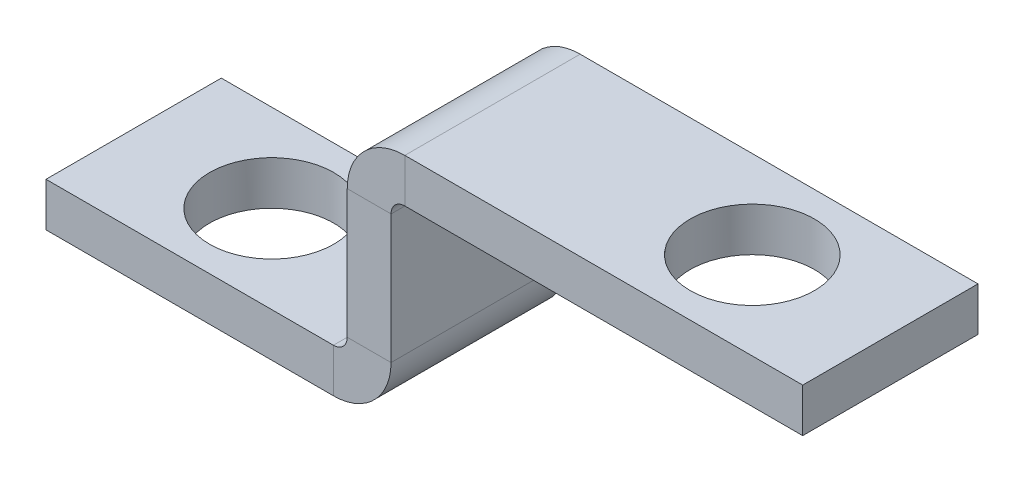
ISO-10303-21;
HEADER;
FILE_DESCRIPTION(('STEP AP214'),'2;1');
FILE_NAME('part.step','',(''),(''),'','','');
FILE_SCHEMA(('AUTOMOTIVE_DESIGN { 1 0 10303 214 1 1 1 1 }'));
ENDSEC;
DATA;
#1=APPLICATION_CONTEXT('core data for automotive mechanical design processes');
#2=APPLICATION_PROTOCOL_DEFINITION('international standard','automotive_design',2000,#1);
#3=PRODUCT_CONTEXT('',#1,'mechanical');
#4=PRODUCT('Part','Part','',(#3));
#5=PRODUCT_RELATED_PRODUCT_CATEGORY('part','',(#4));
#6=PRODUCT_DEFINITION_FORMATION('','',#4);
#7=PRODUCT_DEFINITION_CONTEXT('part definition',#1,'design');
#8=PRODUCT_DEFINITION('design','',#6,#7);
#9=PRODUCT_DEFINITION_SHAPE('','',#8);
#10=(LENGTH_UNIT() NAMED_UNIT(*) SI_UNIT(.MILLI.,.METRE.));
#11=(NAMED_UNIT(*) PLANE_ANGLE_UNIT() SI_UNIT($,.RADIAN.));
#12=(NAMED_UNIT(*) SI_UNIT($,.STERADIAN.) SOLID_ANGLE_UNIT());
#13=UNCERTAINTY_MEASURE_WITH_UNIT(LENGTH_MEASURE(1.E-05),#10,'distance_accuracy_value','');
#14=(GEOMETRIC_REPRESENTATION_CONTEXT(3) GLOBAL_UNCERTAINTY_ASSIGNED_CONTEXT((#13)) GLOBAL_UNIT_ASSIGNED_CONTEXT((#10,
#11,#12)) REPRESENTATION_CONTEXT('',''));
#15=CARTESIAN_POINT('',(0.,0.,0.));
#16=DIRECTION('',(0.,0.,1.));
#17=DIRECTION('',(1.,0.,0.));
#18=AXIS2_PLACEMENT_3D('',#15,#16,#17);
#19=CARTESIAN_POINT('',(25.,14.5,-12.7));
#20=DIRECTION('',(0.,0.,1.));
#21=DIRECTION('',(1.,0.,0.));
#22=AXIS2_PLACEMENT_3D('',#19,#20,#21);
#23=PLANE('',#22);
#24=DIRECTION('',(-1.,0.,0.));
#25=VECTOR('',#24,1.);
#26=CARTESIAN_POINT('',(25.,13.5,-12.7));
#27=LINE('',#26,#25);
#28=CARTESIAN_POINT('',(25.,13.5,-12.7));
#29=VERTEX_POINT('',#28);
#30=CARTESIAN_POINT('',(21.825,13.5,-12.7));
#31=VERTEX_POINT('',#30);
#32=EDGE_CURVE('E208',#29,#31,#27,.T.);
#33=ORIENTED_EDGE('',*,*,#32,.F.);
#34=DIRECTION('',(0.,1.,0.));
#35=VECTOR('',#34,1.);
#36=CARTESIAN_POINT('',(25.,0.,-12.7));
#37=LINE('',#36,#35);
#38=CARTESIAN_POINT('',(25.,4.17499999999999,-12.7));
#39=VERTEX_POINT('',#38);
#40=EDGE_CURVE('E215',#39,#29,#37,.T.);
#41=ORIENTED_EDGE('',*,*,#40,.F.);
#42=DIRECTION('',(-1.,0.,0.));
#43=VECTOR('',#42,1.);
#44=CARTESIAN_POINT('',(21.825,4.175,-12.7));
#45=LINE('',#44,#43);
#46=CARTESIAN_POINT('',(21.825,4.175,-12.7));
#47=VERTEX_POINT('',#46);
#48=EDGE_CURVE('E225',#47,#39,#45,.F.);
#49=ORIENTED_EDGE('',*,*,#48,.F.);
#50=DIRECTION('',(0.,-1.,0.));
#51=VECTOR('',#50,1.);
#52=CARTESIAN_POINT('',(21.825,14.5,-12.7));
#53=LINE('',#52,#51);
#54=EDGE_CURVE('E220',#47,#31,#53,.F.);
#55=ORIENTED_EDGE('',*,*,#54,.T.);
#56=EDGE_LOOP('',(#33,#41,#49,#55));
#57=FACE_BOUND('',#56,.T.);
#58=ADVANCED_FACE('F59',(#57),#23,.F.);
#59=CARTESIAN_POINT('',(25.,3.17499999999999,0.));
#60=DIRECTION('',(0.,0.,-1.));
#61=DIRECTION('',(-1.,0.,0.));
#62=AXIS2_PLACEMENT_3D('',#59,#60,#61);
#63=PLANE('',#62);
#64=DIRECTION('',(-1.,0.,0.));
#65=VECTOR('',#64,1.);
#66=CARTESIAN_POINT('',(25.,13.5,0.));
#67=LINE('',#66,#65);
#68=CARTESIAN_POINT('',(25.,13.5,0.));
#69=VERTEX_POINT('',#68);
#70=CARTESIAN_POINT('',(21.825,13.5,0.));
#71=VERTEX_POINT('',#70);
#72=EDGE_CURVE('E201',#69,#71,#67,.T.);
#73=ORIENTED_EDGE('',*,*,#72,.T.);
#74=DIRECTION('',(0.,1.,0.));
#75=VECTOR('',#74,1.);
#76=CARTESIAN_POINT('',(21.825,3.175,0.));
#77=LINE('',#76,#75);
#78=CARTESIAN_POINT('',(21.825,4.175,0.));
#79=VERTEX_POINT('',#78);
#80=EDGE_CURVE('E218',#71,#79,#77,.F.);
#81=ORIENTED_EDGE('',*,*,#80,.T.);
#82=DIRECTION('',(-1.,0.,0.));
#83=VECTOR('',#82,1.);
#84=CARTESIAN_POINT('',(25.,4.17499999999999,0.));
#85=LINE('',#84,#83);
#86=CARTESIAN_POINT('',(25.,4.17499999999999,0.));
#87=VERTEX_POINT('',#86);
#88=EDGE_CURVE('E210',#79,#87,#85,.F.);
#89=ORIENTED_EDGE('',*,*,#88,.T.);
#90=DIRECTION('',(0.,-1.,0.));
#91=VECTOR('',#90,1.);
#92=CARTESIAN_POINT('',(25.,0.,0.));
#93=LINE('',#92,#91);
#94=EDGE_CURVE('E212',#69,#87,#93,.T.);
#95=ORIENTED_EDGE('',*,*,#94,.F.);
#96=EDGE_LOOP('',(#73,#81,#89,#95));
#97=FACE_BOUND('',#96,.T.);
#98=ADVANCED_FACE('F307',(#97),#63,.F.);
#99=CARTESIAN_POINT('',(25.,0.,0.));
#100=DIRECTION('',(-1.,0.,0.));
#101=DIRECTION('',(0.,-1.,0.));
#102=AXIS2_PLACEMENT_3D('',#99,#100,#101);
#103=PLANE('',#102);
#104=DIRECTION('',(0.,0.,1.));
#105=VECTOR('',#104,1.);
#106=CARTESIAN_POINT('',(25.,13.5,0.));
#107=LINE('',#106,#105);
#108=EDGE_CURVE('E205',#69,#29,#107,.F.);
#109=ORIENTED_EDGE('',*,*,#108,.F.);
#110=ORIENTED_EDGE('',*,*,#94,.T.);
#111=DIRECTION('',(0.,0.,-1.));
#112=VECTOR('',#111,1.);
#113=CARTESIAN_POINT('',(25.,4.17499999999999,0.));
#114=LINE('',#113,#112);
#115=EDGE_CURVE('E223',#39,#87,#114,.F.);
#116=ORIENTED_EDGE('',*,*,#115,.F.);
#117=ORIENTED_EDGE('',*,*,#40,.T.);
#118=EDGE_LOOP('',(#109,#110,#116,#117));
#119=FACE_BOUND('',#118,.T.);
#120=ADVANCED_FACE('F302',(#119),#103,.F.);
#121=CARTESIAN_POINT('',(21.825,0.,0.));
#122=DIRECTION('',(-1.,0.,0.));
#123=DIRECTION('',(0.,-1.,0.));
#124=AXIS2_PLACEMENT_3D('',#121,#122,#123);
#125=PLANE('',#124);
#126=ORIENTED_EDGE('',*,*,#80,.F.);
#127=DIRECTION('',(0.,0.,1.));
#128=VECTOR('',#127,1.);
#129=CARTESIAN_POINT('',(21.825,13.5,0.));
#130=LINE('',#129,#128);
#131=EDGE_CURVE('E155',#71,#31,#130,.F.);
#132=ORIENTED_EDGE('',*,*,#131,.T.);
#133=ORIENTED_EDGE('',*,*,#54,.F.);
#134=DIRECTION('',(0.,0.,-1.));
#135=VECTOR('',#134,1.);
#136=CARTESIAN_POINT('',(21.825,4.175,0.));
#137=LINE('',#136,#135);
#138=EDGE_CURVE('E228',#79,#47,#137,.T.);
#139=ORIENTED_EDGE('',*,*,#138,.F.);
#140=EDGE_LOOP('',(#126,#132,#133,#139));
#141=FACE_BOUND('',#140,.T.);
#142=ADVANCED_FACE('F295',(#141),#125,.T.);
#143=CARTESIAN_POINT('',(0.,3.175,-12.7));
#144=DIRECTION('',(0.,0.,1.));
#145=DIRECTION('',(-1.,0.,0.));
#146=AXIS2_PLACEMENT_3D('',#143,#144,#145);
#147=PLANE('',#146);
#148=DIRECTION('',(-1.,0.,0.));
#149=VECTOR('',#148,1.);
#150=CARTESIAN_POINT('',(0.,3.175,-12.7));
#151=LINE('',#150,#149);
#152=CARTESIAN_POINT('',(20.825,3.175,-12.7));
#153=VERTEX_POINT('',#152);
#154=CARTESIAN_POINT('',(0.,3.175,-12.7));
#155=VERTEX_POINT('',#154);
#156=EDGE_CURVE('E259',#153,#155,#151,.T.);
#157=ORIENTED_EDGE('',*,*,#156,.F.);
#158=DIRECTION('',(0.,-1.,0.));
#159=VECTOR('',#158,1.);
#160=CARTESIAN_POINT('',(20.825,3.175,-12.7));
#161=LINE('',#160,#159);
#162=CARTESIAN_POINT('',(20.825,0.,-12.7));
#163=VERTEX_POINT('',#162);
#164=EDGE_CURVE('E237',#153,#163,#161,.T.);
#165=ORIENTED_EDGE('',*,*,#164,.T.);
#166=DIRECTION('',(1.,0.,0.));
#167=VECTOR('',#166,1.);
#168=CARTESIAN_POINT('',(0.,0.,-12.7));
#169=LINE('',#168,#167);
#170=CARTESIAN_POINT('',(0.,0.,-12.7));
#171=VERTEX_POINT('',#170);
#172=EDGE_CURVE('E256',#163,#171,#169,.F.);
#173=ORIENTED_EDGE('',*,*,#172,.T.);
#174=DIRECTION('',(0.,1.,0.));
#175=VECTOR('',#174,1.);
#176=CARTESIAN_POINT('',(0.,3.175,-12.7));
#177=LINE('',#176,#175);
#178=EDGE_CURVE('E13',#171,#155,#177,.T.);
#179=ORIENTED_EDGE('',*,*,#178,.T.);
#180=EDGE_LOOP('',(#157,#165,#173,#179));
#181=FACE_BOUND('',#180,.T.);
#182=ADVANCED_FACE('F293',(#181),#147,.F.);
#183=CARTESIAN_POINT('',(0.,3.175,0.));
#184=DIRECTION('',(0.,-1.,0.));
#185=DIRECTION('',(0.,0.,-1.));
#186=AXIS2_PLACEMENT_3D('',#183,#184,#185);
#187=PLANE('',#186);
#188=CARTESIAN_POINT('',(10.,3.175,-6.34999999999999));
#189=DIRECTION('',(0.,-1.,0.));
#190=DIRECTION('',(0.,0.,-1.));
#191=AXIS2_PLACEMENT_3D('',#188,#189,#190);
#192=CIRCLE('',#191,4.5);
#193=CARTESIAN_POINT('',(10.,3.175,-10.85));
#194=VERTEX_POINT('',#193);
#195=EDGE_CURVE('E579',#194,#194,#192,.T.);
#196=ORIENTED_EDGE('',*,*,#195,.T.);
#197=EDGE_LOOP('',(#196));
#198=FACE_BOUND('',#197,.T.);
#199=DIRECTION('',(0.,0.,-1.));
#200=VECTOR('',#199,1.);
#201=CARTESIAN_POINT('',(20.825,3.175,-12.7));
#202=LINE('',#201,#200);
#203=CARTESIAN_POINT('',(20.825,3.175,0.));
#204=VERTEX_POINT('',#203);
#205=EDGE_CURVE('E243',#153,#204,#202,.F.);
#206=ORIENTED_EDGE('',*,*,#205,.F.);
#207=ORIENTED_EDGE('',*,*,#156,.T.);
#208=DIRECTION('',(0.,0.,1.));
#209=VECTOR('',#208,1.);
#210=CARTESIAN_POINT('',(0.,3.175,0.));
#211=LINE('',#210,#209);
#212=CARTESIAN_POINT('',(0.,3.175,0.));
#213=VERTEX_POINT('',#212);
#214=EDGE_CURVE('E252',#155,#213,#211,.T.);
#215=ORIENTED_EDGE('',*,*,#214,.T.);
#216=DIRECTION('',(1.,0.,0.));
#217=VECTOR('',#216,1.);
#218=CARTESIAN_POINT('',(0.,3.175,0.));
#219=LINE('',#218,#217);
#220=EDGE_CURVE('E255',#213,#204,#219,.T.);
#221=ORIENTED_EDGE('',*,*,#220,.T.);
#222=EDGE_LOOP('',(#206,#207,#215,#221));
#223=FACE_BOUND('',#222,.T.);
#224=ADVANCED_FACE('F276',(#198,#223),#187,.F.);
#225=CARTESIAN_POINT('',(0.,0.,0.));
#226=DIRECTION('',(0.,-1.,0.));
#227=DIRECTION('',(0.,0.,-1.));
#228=AXIS2_PLACEMENT_3D('',#225,#226,#227);
#229=PLANE('',#228);
#230=CARTESIAN_POINT('',(10.,0.,-6.34999999999999));
#231=DIRECTION('',(0.,1.,0.));
#232=DIRECTION('',(0.,0.,1.));
#233=AXIS2_PLACEMENT_3D('',#230,#231,#232);
#234=CIRCLE('',#233,4.5);
#235=CARTESIAN_POINT('',(10.,0.,-1.85));
#236=VERTEX_POINT('',#235);
#237=EDGE_CURVE('E581',#236,#236,#234,.T.);
#238=ORIENTED_EDGE('',*,*,#237,.T.);
#239=EDGE_LOOP('',(#238));
#240=FACE_BOUND('',#239,.T.);
#241=ORIENTED_EDGE('',*,*,#172,.F.);
#242=DIRECTION('',(0.,0.,-1.));
#243=VECTOR('',#242,1.);
#244=CARTESIAN_POINT('',(20.825,0.,-12.7));
#245=LINE('',#244,#243);
#246=CARTESIAN_POINT('',(20.825,0.,0.));
#247=VERTEX_POINT('',#246);
#248=EDGE_CURVE('E232',#163,#247,#245,.F.);
#249=ORIENTED_EDGE('',*,*,#248,.T.);
#250=DIRECTION('',(1.,0.,0.));
#251=VECTOR('',#250,1.);
#252=CARTESIAN_POINT('',(0.,0.,0.));
#253=LINE('',#252,#251);
#254=CARTESIAN_POINT('',(0.,0.,0.));
#255=VERTEX_POINT('',#254);
#256=EDGE_CURVE('E263',#255,#247,#253,.T.);
#257=ORIENTED_EDGE('',*,*,#256,.F.);
#258=DIRECTION('',(0.,0.,-1.));
#259=VECTOR('',#258,1.);
#260=CARTESIAN_POINT('',(0.,0.,0.));
#261=LINE('',#260,#259);
#262=EDGE_CURVE('E249',#171,#255,#261,.F.);
#263=ORIENTED_EDGE('',*,*,#262,.F.);
#264=EDGE_LOOP('',(#241,#249,#257,#263));
#265=FACE_BOUND('',#264,.T.);
#266=ADVANCED_FACE('F285',(#240,#265),#229,.T.);
#267=CARTESIAN_POINT('',(0.,3.175,0.));
#268=DIRECTION('',(1.,0.,0.));
#269=DIRECTION('',(0.,0.,1.));
#270=AXIS2_PLACEMENT_3D('',#267,#268,#269);
#271=PLANE('',#270);
#272=ORIENTED_EDGE('',*,*,#178,.F.);
#273=ORIENTED_EDGE('',*,*,#262,.T.);
#274=DIRECTION('',(0.,1.,0.));
#275=VECTOR('',#274,1.);
#276=CARTESIAN_POINT('',(0.,3.175,0.));
#277=LINE('',#276,#275);
#278=EDGE_CURVE('E68',#255,#213,#277,.T.);
#279=ORIENTED_EDGE('',*,*,#278,.T.);
#280=ORIENTED_EDGE('',*,*,#214,.F.);
#281=EDGE_LOOP('',(#272,#273,#279,#280));
#282=FACE_BOUND('',#281,.T.);
#283=ADVANCED_FACE('F269',(#282),#271,.F.);
#284=CARTESIAN_POINT('',(0.,3.175,0.));
#285=DIRECTION('',(0.,0.,-1.));
#286=DIRECTION('',(1.,0.,0.));
#287=AXIS2_PLACEMENT_3D('',#284,#285,#286);
#288=PLANE('',#287);
#289=DIRECTION('',(0.,-1.,0.));
#290=VECTOR('',#289,1.);
#291=CARTESIAN_POINT('',(20.825,3.175,0.));
#292=LINE('',#291,#290);
#293=EDGE_CURVE('E247',#204,#247,#292,.T.);
#294=ORIENTED_EDGE('',*,*,#293,.F.);
#295=ORIENTED_EDGE('',*,*,#220,.F.);
#296=ORIENTED_EDGE('',*,*,#278,.F.);
#297=ORIENTED_EDGE('',*,*,#256,.T.);
#298=EDGE_LOOP('',(#294,#295,#296,#297));
#299=FACE_BOUND('',#298,.T.);
#300=ADVANCED_FACE('F61',(#299),#288,.F.);
#301=CARTESIAN_POINT('',(20.825,4.175,0.));
#302=DIRECTION('',(0.,0.,1.));
#303=DIRECTION('',(1.,0.,0.));
#304=AXIS2_PLACEMENT_3D('',#301,#302,#303);
#305=PLANE('',#304);
#306=ORIENTED_EDGE('',*,*,#88,.F.);
#307=CARTESIAN_POINT('',(20.825,4.175,0.));
#308=DIRECTION('',(0.,0.,-1.));
#309=DIRECTION('',(-1.,0.,0.));
#310=AXIS2_PLACEMENT_3D('',#307,#308,#309);
#311=CIRCLE('',#310,1.);
#312=EDGE_CURVE('E240',#204,#79,#311,.F.);
#313=ORIENTED_EDGE('',*,*,#312,.F.);
#314=ORIENTED_EDGE('',*,*,#293,.T.);
#315=CARTESIAN_POINT('',(20.825,4.175,0.));
#316=DIRECTION('',(0.,0.,-1.));
#317=DIRECTION('',(-1.,0.,0.));
#318=AXIS2_PLACEMENT_3D('',#315,#316,#317);
#319=CIRCLE('',#318,4.175);
#320=EDGE_CURVE('E84',#247,#87,#319,.F.);
#321=ORIENTED_EDGE('',*,*,#320,.T.);
#322=EDGE_LOOP('',(#306,#313,#314,#321));
#323=FACE_BOUND('',#322,.T.);
#324=ADVANCED_FACE('F282',(#323),#305,.T.);
#325=CARTESIAN_POINT('',(20.825,4.175,-12.7));
#326=DIRECTION('',(0.,0.,1.));
#327=DIRECTION('',(1.,0.,0.));
#328=AXIS2_PLACEMENT_3D('',#325,#326,#327);
#329=PLANE('',#328);
#330=CARTESIAN_POINT('',(20.825,4.175,-12.7));
#331=DIRECTION('',(0.,0.,-1.));
#332=DIRECTION('',(-1.,0.,0.));
#333=AXIS2_PLACEMENT_3D('',#330,#331,#332);
#334=CIRCLE('',#333,1.);
#335=EDGE_CURVE('E214',#47,#153,#334,.T.);
#336=ORIENTED_EDGE('',*,*,#335,.F.);
#337=ORIENTED_EDGE('',*,*,#48,.T.);
#338=CARTESIAN_POINT('',(20.825,4.175,-12.7));
#339=DIRECTION('',(0.,0.,-1.));
#340=DIRECTION('',(-1.,0.,0.));
#341=AXIS2_PLACEMENT_3D('',#338,#339,#340);
#342=CIRCLE('',#341,4.175);
#343=EDGE_CURVE('E235',#39,#163,#342,.T.);
#344=ORIENTED_EDGE('',*,*,#343,.T.);
#345=ORIENTED_EDGE('',*,*,#164,.F.);
#346=EDGE_LOOP('',(#336,#337,#344,#345));
#347=FACE_BOUND('',#346,.T.);
#348=ADVANCED_FACE('F289',(#347),#329,.F.);
#349=CARTESIAN_POINT('',(20.825,4.175,-12.7));
#350=DIRECTION('',(0.,0.,-1.));
#351=DIRECTION('',(1.,0.,0.));
#352=AXIS2_PLACEMENT_3D('',#349,#350,#351);
#353=CYLINDRICAL_SURFACE('',#352,4.175);
#354=ORIENTED_EDGE('',*,*,#248,.F.);
#355=ORIENTED_EDGE('',*,*,#343,.F.);
#356=ORIENTED_EDGE('',*,*,#115,.T.);
#357=ORIENTED_EDGE('',*,*,#320,.F.);
#358=EDGE_LOOP('',(#354,#355,#356,#357));
#359=FACE_BOUND('',#358,.T.);
#360=ADVANCED_FACE('F286',(#359),#353,.T.);
#361=CARTESIAN_POINT('',(20.825,4.175,-12.7));
#362=DIRECTION('',(0.,0.,-1.));
#363=DIRECTION('',(1.,0.,0.));
#364=AXIS2_PLACEMENT_3D('',#361,#362,#363);
#365=CYLINDRICAL_SURFACE('',#364,1.);
#366=ORIENTED_EDGE('',*,*,#205,.T.);
#367=ORIENTED_EDGE('',*,*,#312,.T.);
#368=ORIENTED_EDGE('',*,*,#138,.T.);
#369=ORIENTED_EDGE('',*,*,#335,.T.);
#370=EDGE_LOOP('',(#366,#367,#368,#369));
#371=FACE_BOUND('',#370,.T.);
#372=ADVANCED_FACE('F319',(#371),#365,.F.);
#373=CARTESIAN_POINT('',(26.,13.5,-12.7));
#374=DIRECTION('',(0.,0.,-1.));
#375=DIRECTION('',(-1.,0.,0.));
#376=AXIS2_PLACEMENT_3D('',#373,#374,#375);
#377=PLANE('',#376);
#378=DIRECTION('',(0.,1.,0.));
#379=VECTOR('',#378,1.);
#380=CARTESIAN_POINT('',(26.,14.5,-12.7));
#381=LINE('',#380,#379);
#382=CARTESIAN_POINT('',(26.,14.5,-12.7));
#383=VERTEX_POINT('',#382);
#384=CARTESIAN_POINT('',(26.,17.675,-12.7));
#385=VERTEX_POINT('',#384);
#386=EDGE_CURVE('E572',#383,#385,#381,.T.);
#387=ORIENTED_EDGE('',*,*,#386,.F.);
#388=CARTESIAN_POINT('',(26.,13.5,-12.7));
#389=DIRECTION('',(0.,0.,1.));
#390=DIRECTION('',(1.,0.,0.));
#391=AXIS2_PLACEMENT_3D('',#388,#389,#390);
#392=CIRCLE('',#391,1.);
#393=EDGE_CURVE('E158',#29,#383,#392,.F.);
#394=ORIENTED_EDGE('',*,*,#393,.F.);
#395=ORIENTED_EDGE('',*,*,#32,.T.);
#396=CARTESIAN_POINT('',(26.,13.5,-12.7));
#397=DIRECTION('',(0.,0.,1.));
#398=DIRECTION('',(1.,0.,0.));
#399=AXIS2_PLACEMENT_3D('',#396,#397,#398);
#400=CIRCLE('',#399,4.175);
#401=EDGE_CURVE('E76',#31,#385,#400,.F.);
#402=ORIENTED_EDGE('',*,*,#401,.T.);
#403=EDGE_LOOP('',(#387,#394,#395,#402));
#404=FACE_BOUND('',#403,.T.);
#405=ADVANCED_FACE('F322',(#404),#377,.T.);
#406=CARTESIAN_POINT('',(26.,13.5,0.));
#407=DIRECTION('',(0.,0.,-1.));
#408=DIRECTION('',(-1.,0.,0.));
#409=AXIS2_PLACEMENT_3D('',#406,#407,#408);
#410=PLANE('',#409);
#411=CARTESIAN_POINT('',(26.,13.5,0.));
#412=DIRECTION('',(0.,0.,1.));
#413=DIRECTION('',(1.,0.,0.));
#414=AXIS2_PLACEMENT_3D('',#411,#412,#413);
#415=CIRCLE('',#414,1.);
#416=CARTESIAN_POINT('',(26.,14.5,0.));
#417=VERTEX_POINT('',#416);
#418=EDGE_CURVE('E165',#417,#69,#415,.T.);
#419=ORIENTED_EDGE('',*,*,#418,.F.);
#420=DIRECTION('',(0.,1.,0.));
#421=VECTOR('',#420,1.);
#422=CARTESIAN_POINT('',(26.,14.5,0.));
#423=LINE('',#422,#421);
#424=CARTESIAN_POINT('',(26.,17.675,0.));
#425=VERTEX_POINT('',#424);
#426=EDGE_CURVE('E162',#417,#425,#423,.T.);
#427=ORIENTED_EDGE('',*,*,#426,.T.);
#428=CARTESIAN_POINT('',(26.,13.5,0.));
#429=DIRECTION('',(0.,0.,1.));
#430=DIRECTION('',(1.,0.,0.));
#431=AXIS2_PLACEMENT_3D('',#428,#429,#430);
#432=CIRCLE('',#431,4.175);
#433=EDGE_CURVE('E149',#425,#71,#432,.T.);
#434=ORIENTED_EDGE('',*,*,#433,.T.);
#435=ORIENTED_EDGE('',*,*,#72,.F.);
#436=EDGE_LOOP('',(#419,#427,#434,#435));
#437=FACE_BOUND('',#436,.T.);
#438=ADVANCED_FACE('F163',(#437),#410,.F.);
#439=CARTESIAN_POINT('',(26.,13.5,0.));
#440=DIRECTION('',(0.,0.,1.));
#441=DIRECTION('',(0.,1.,0.));
#442=AXIS2_PLACEMENT_3D('',#439,#440,#441);
#443=CYLINDRICAL_SURFACE('',#442,4.175);
#444=ORIENTED_EDGE('',*,*,#131,.F.);
#445=ORIENTED_EDGE('',*,*,#433,.F.);
#446=DIRECTION('',(0.,0.,-1.));
#447=VECTOR('',#446,1.);
#448=CARTESIAN_POINT('',(26.,17.675,0.));
#449=LINE('',#448,#447);
#450=EDGE_CURVE('E153',#425,#385,#449,.T.);
#451=ORIENTED_EDGE('',*,*,#450,.T.);
#452=ORIENTED_EDGE('',*,*,#401,.F.);
#453=EDGE_LOOP('',(#444,#445,#451,#452));
#454=FACE_BOUND('',#453,.T.);
#455=ADVANCED_FACE('F151',(#454),#443,.T.);
#456=CARTESIAN_POINT('',(26.,13.5,0.));
#457=DIRECTION('',(0.,0.,1.));
#458=DIRECTION('',(0.,1.,0.));
#459=AXIS2_PLACEMENT_3D('',#456,#457,#458);
#460=CYLINDRICAL_SURFACE('',#459,1.);
#461=ORIENTED_EDGE('',*,*,#108,.T.);
#462=ORIENTED_EDGE('',*,*,#393,.T.);
#463=DIRECTION('',(0.,0.,1.));
#464=VECTOR('',#463,1.);
#465=CARTESIAN_POINT('',(26.,14.5,-12.7));
#466=LINE('',#465,#464);
#467=EDGE_CURVE('E169',#383,#417,#466,.T.);
#468=ORIENTED_EDGE('',*,*,#467,.T.);
#469=ORIENTED_EDGE('',*,*,#418,.T.);
#470=EDGE_LOOP('',(#461,#462,#468,#469));
#471=FACE_BOUND('',#470,.T.);
#472=ADVANCED_FACE('F372',(#471),#460,.F.);
#473=CARTESIAN_POINT('',(54.8250000000001,17.675,0.));
#474=DIRECTION('',(0.,0.,-1.));
#475=DIRECTION('',(-1.,0.,0.));
#476=AXIS2_PLACEMENT_3D('',#473,#474,#475);
#477=PLANE('',#476);
#478=ORIENTED_EDGE('',*,*,#426,.F.);
#479=DIRECTION('',(1.,0.,0.));
#480=VECTOR('',#479,1.);
#481=CARTESIAN_POINT('',(54.8250000000001,14.5,0.));
#482=LINE('',#481,#480);
#483=CARTESIAN_POINT('',(54.8250000000001,14.5,0.));
#484=VERTEX_POINT('',#483);
#485=EDGE_CURVE('E178',#417,#484,#482,.T.);
#486=ORIENTED_EDGE('',*,*,#485,.T.);
#487=DIRECTION('',(0.,-1.,0.));
#488=VECTOR('',#487,1.);
#489=CARTESIAN_POINT('',(54.8250000000001,17.675,0.));
#490=LINE('',#489,#488);
#491=CARTESIAN_POINT('',(54.8250000000001,17.675,0.));
#492=VERTEX_POINT('',#491);
#493=EDGE_CURVE('E182',#492,#484,#490,.T.);
#494=ORIENTED_EDGE('',*,*,#493,.F.);
#495=DIRECTION('',(1.,0.,0.));
#496=VECTOR('',#495,1.);
#497=CARTESIAN_POINT('',(54.8250000000001,17.675,0.));
#498=LINE('',#497,#496);
#499=EDGE_CURVE('E174',#425,#492,#498,.T.);
#500=ORIENTED_EDGE('',*,*,#499,.F.);
#501=EDGE_LOOP('',(#478,#486,#494,#500));
#502=FACE_BOUND('',#501,.T.);
#503=ADVANCED_FACE('F180',(#502),#477,.F.);
#504=CARTESIAN_POINT('',(25.,17.675,-12.7));
#505=DIRECTION('',(0.,0.,1.));
#506=DIRECTION('',(1.,0.,0.));
#507=AXIS2_PLACEMENT_3D('',#504,#505,#506);
#508=PLANE('',#507);
#509=ORIENTED_EDGE('',*,*,#386,.T.);
#510=DIRECTION('',(-1.,0.,0.));
#511=VECTOR('',#510,1.);
#512=CARTESIAN_POINT('',(25.,17.675,-12.7));
#513=LINE('',#512,#511);
#514=CARTESIAN_POINT('',(54.8250000000001,17.675,-12.7));
#515=VERTEX_POINT('',#514);
#516=EDGE_CURVE('E177',#515,#385,#513,.T.);
#517=ORIENTED_EDGE('',*,*,#516,.F.);
#518=DIRECTION('',(0.,-1.,0.));
#519=VECTOR('',#518,1.);
#520=CARTESIAN_POINT('',(54.8250000000001,17.675,-12.7));
#521=LINE('',#520,#519);
#522=CARTESIAN_POINT('',(54.8250000000001,14.5,-12.7));
#523=VERTEX_POINT('',#522);
#524=EDGE_CURVE('E194',#515,#523,#521,.T.);
#525=ORIENTED_EDGE('',*,*,#524,.T.);
#526=DIRECTION('',(-1.,0.,0.));
#527=VECTOR('',#526,1.);
#528=CARTESIAN_POINT('',(25.,14.5,-12.7));
#529=LINE('',#528,#527);
#530=EDGE_CURVE('E185',#523,#383,#529,.T.);
#531=ORIENTED_EDGE('',*,*,#530,.T.);
#532=EDGE_LOOP('',(#509,#517,#525,#531));
#533=FACE_BOUND('',#532,.T.);
#534=ADVANCED_FACE('F386',(#533),#508,.F.);
#535=CARTESIAN_POINT('',(0.,17.675,0.));
#536=DIRECTION('',(0.,-1.,0.));
#537=DIRECTION('',(1.,0.,0.));
#538=AXIS2_PLACEMENT_3D('',#535,#536,#537);
#539=PLANE('',#538);
#540=CARTESIAN_POINT('',(44.8250000000001,17.675,-6.35));
#541=DIRECTION('',(0.,1.,0.));
#542=DIRECTION('',(0.,0.,1.));
#543=AXIS2_PLACEMENT_3D('',#540,#541,#542);
#544=CIRCLE('',#543,4.5);
#545=CARTESIAN_POINT('',(44.8250000000001,17.675,-1.85));
#546=VERTEX_POINT('',#545);
#547=EDGE_CURVE('E586',#546,#546,#544,.T.);
#548=ORIENTED_EDGE('',*,*,#547,.F.);
#549=EDGE_LOOP('',(#548));
#550=FACE_BOUND('',#549,.T.);
#551=ORIENTED_EDGE('',*,*,#450,.F.);
#552=ORIENTED_EDGE('',*,*,#499,.T.);
#553=DIRECTION('',(0.,0.,-1.));
#554=VECTOR('',#553,1.);
#555=CARTESIAN_POINT('',(54.8250000000001,17.675,-12.7));
#556=LINE('',#555,#554);
#557=EDGE_CURVE('E184',#492,#515,#556,.T.);
#558=ORIENTED_EDGE('',*,*,#557,.T.);
#559=ORIENTED_EDGE('',*,*,#516,.T.);
#560=EDGE_LOOP('',(#551,#552,#558,#559));
#561=FACE_BOUND('',#560,.T.);
#562=ADVANCED_FACE('F173',(#550,#561),#539,.F.);
#563=CARTESIAN_POINT('',(0.,14.5,0.));
#564=DIRECTION('',(0.,-1.,0.));
#565=DIRECTION('',(1.,0.,0.));
#566=AXIS2_PLACEMENT_3D('',#563,#564,#565);
#567=PLANE('',#566);
#568=CARTESIAN_POINT('',(44.8250000000001,14.5,-6.35));
#569=DIRECTION('',(0.,-1.,0.));
#570=DIRECTION('',(1.,0.,0.));
#571=AXIS2_PLACEMENT_3D('',#568,#569,#570);
#572=CIRCLE('',#571,4.5);
#573=CARTESIAN_POINT('',(49.3250000000001,14.5,-6.35));
#574=VERTEX_POINT('',#573);
#575=EDGE_CURVE('E63',#574,#574,#572,.T.);
#576=ORIENTED_EDGE('',*,*,#575,.F.);
#577=EDGE_LOOP('',(#576));
#578=FACE_BOUND('',#577,.T.);
#579=ORIENTED_EDGE('',*,*,#485,.F.);
#580=ORIENTED_EDGE('',*,*,#467,.F.);
#581=ORIENTED_EDGE('',*,*,#530,.F.);
#582=DIRECTION('',(0.,0.,-1.));
#583=VECTOR('',#582,1.);
#584=CARTESIAN_POINT('',(54.8250000000001,14.5,-12.7));
#585=LINE('',#584,#583);
#586=EDGE_CURVE('E189',#484,#523,#585,.T.);
#587=ORIENTED_EDGE('',*,*,#586,.F.);
#588=EDGE_LOOP('',(#579,#580,#581,#587));
#589=FACE_BOUND('',#588,.T.);
#590=ADVANCED_FACE('F401',(#578,#589),#567,.T.);
#591=CARTESIAN_POINT('',(54.8250000000001,17.675,-12.7));
#592=DIRECTION('',(-1.,0.,0.));
#593=DIRECTION('',(0.,-1.,0.));
#594=AXIS2_PLACEMENT_3D('',#591,#592,#593);
#595=PLANE('',#594);
#596=ORIENTED_EDGE('',*,*,#586,.T.);
#597=ORIENTED_EDGE('',*,*,#524,.F.);
#598=ORIENTED_EDGE('',*,*,#557,.F.);
#599=ORIENTED_EDGE('',*,*,#493,.T.);
#600=EDGE_LOOP('',(#596,#597,#598,#599));
#601=FACE_BOUND('',#600,.T.);
#602=ADVANCED_FACE('F410',(#601),#595,.F.);
#603=CARTESIAN_POINT('',(10.,17.675,-6.34999999999999));
#604=DIRECTION('',(0.,1.,0.));
#605=DIRECTION('',(0.,0.,1.));
#606=AXIS2_PLACEMENT_3D('',#603,#604,#605);
#607=CYLINDRICAL_SURFACE('',#606,4.5);
#608=ORIENTED_EDGE('',*,*,#237,.F.);
#609=EDGE_LOOP('',(#608));
#610=FACE_BOUND('',#609,.T.);
#611=ORIENTED_EDGE('',*,*,#195,.F.);
#612=EDGE_LOOP('',(#611));
#613=FACE_BOUND('',#612,.T.);
#614=ADVANCED_FACE('F418',(#610,#613),#607,.F.);
#615=CARTESIAN_POINT('',(44.8250000000001,17.675,-6.35));
#616=DIRECTION('',(0.,1.,0.));
#617=DIRECTION('',(0.,0.,1.));
#618=AXIS2_PLACEMENT_3D('',#615,#616,#617);
#619=CYLINDRICAL_SURFACE('',#618,4.5);
#620=ORIENTED_EDGE('',*,*,#575,.T.);
#621=EDGE_LOOP('',(#620));
#622=FACE_BOUND('',#621,.T.);
#623=ORIENTED_EDGE('',*,*,#547,.T.);
#624=EDGE_LOOP('',(#623));
#625=FACE_BOUND('',#624,.T.);
#626=ADVANCED_FACE('F426',(#622,#625),#619,.F.);
#627=CLOSED_SHELL('',(#58,#98,#120,#142,#182,#224,#266,#283,#300,#324,#348,#360,#372,#405,#438,
#455,#472,#503,#534,#562,#590,#602,#614,#626));
#628=MANIFOLD_SOLID_BREP('B2',#627);
#629=ADVANCED_BREP_SHAPE_REPRESENTATION('',(#18,#628),#14);
#630=SHAPE_DEFINITION_REPRESENTATION(#9,#629);
ENDSEC;
END-ISO-10303-21;
